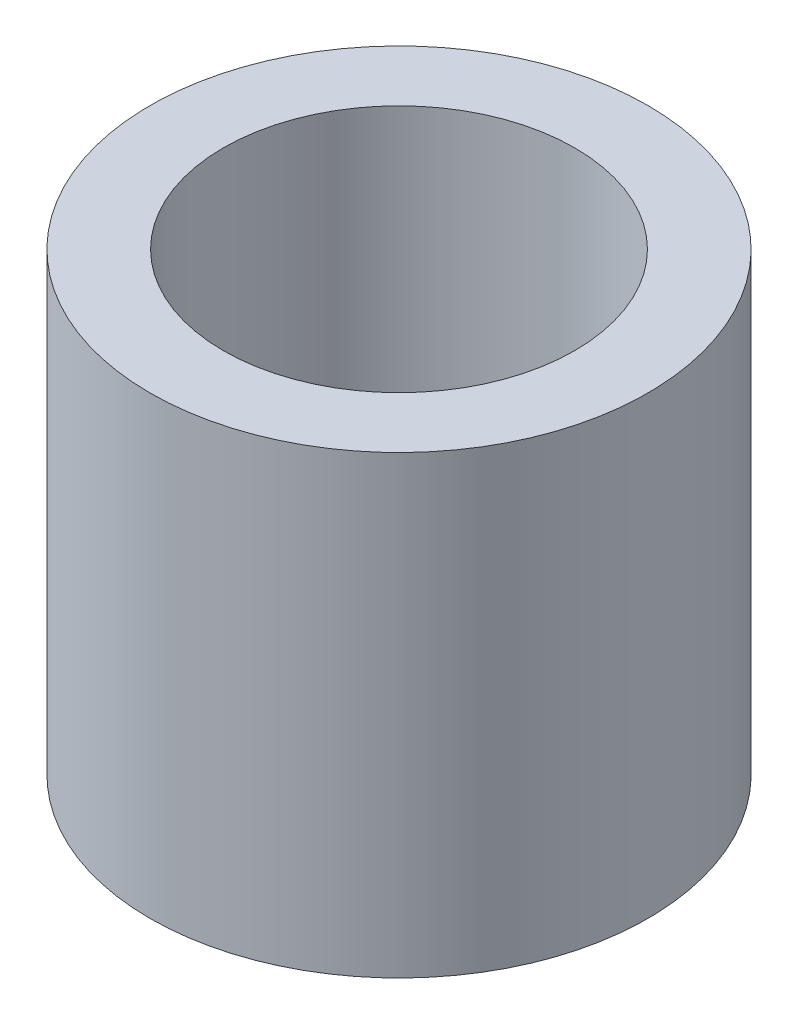
ISO-10303-21;
HEADER;
FILE_DESCRIPTION(('STEP AP214'),'2;1');
FILE_NAME('part.step','',(''),(''),'','','');
FILE_SCHEMA(('AUTOMOTIVE_DESIGN { 1 0 10303 214 1 1 1 1 }'));
ENDSEC;
DATA;
#1=APPLICATION_CONTEXT('core data for automotive mechanical design processes');
#2=APPLICATION_PROTOCOL_DEFINITION('international standard','automotive_design',2000,#1);
#3=PRODUCT_CONTEXT('',#1,'mechanical');
#4=PRODUCT('Part','Part','',(#3));
#5=PRODUCT_RELATED_PRODUCT_CATEGORY('part','',(#4));
#6=PRODUCT_DEFINITION_FORMATION('','',#4);
#7=PRODUCT_DEFINITION_CONTEXT('part definition',#1,'design');
#8=PRODUCT_DEFINITION('design','',#6,#7);
#9=PRODUCT_DEFINITION_SHAPE('','',#8);
#10=(LENGTH_UNIT() NAMED_UNIT(*) SI_UNIT(.MILLI.,.METRE.));
#11=(NAMED_UNIT(*) PLANE_ANGLE_UNIT() SI_UNIT($,.RADIAN.));
#12=(NAMED_UNIT(*) SI_UNIT($,.STERADIAN.) SOLID_ANGLE_UNIT());
#13=UNCERTAINTY_MEASURE_WITH_UNIT(LENGTH_MEASURE(1.E-05),#10,'distance_accuracy_value','');
#14=(GEOMETRIC_REPRESENTATION_CONTEXT(3) GLOBAL_UNCERTAINTY_ASSIGNED_CONTEXT((#13)) GLOBAL_UNIT_ASSIGNED_CONTEXT((#10,
#11,#12)) REPRESENTATION_CONTEXT('',''));
#15=CARTESIAN_POINT('',(0.,0.,0.));
#16=DIRECTION('',(0.,0.,1.));
#17=DIRECTION('',(1.,0.,0.));
#18=AXIS2_PLACEMENT_3D('',#15,#16,#17);
#19=CARTESIAN_POINT('',(0.,59.4069454797538,0.));
#20=DIRECTION('',(0.,-1.,0.));
#21=DIRECTION('',(0.,0.,-1.));
#22=AXIS2_PLACEMENT_3D('',#19,#20,#21);
#23=CYLINDRICAL_SURFACE('',#22,32.5);
#24=CARTESIAN_POINT('',(0.,59.4069454797538,0.));
#25=DIRECTION('',(0.,1.,0.));
#26=DIRECTION('',(0.,0.,1.));
#27=AXIS2_PLACEMENT_3D('',#24,#25,#26);
#28=CIRCLE('',#27,32.5);
#29=CARTESIAN_POINT('',(0.,59.4069454797538,-32.5));
#30=VERTEX_POINT('',#29);
#31=EDGE_CURVE('E10',#30,#30,#28,.T.);
#32=CARTESIAN_POINT('',(0.,0.,0.));
#33=DIRECTION('',(0.,1.,0.));
#34=DIRECTION('',(0.,0.,1.));
#35=AXIS2_PLACEMENT_3D('',#32,#33,#34);
#36=CIRCLE('',#35,32.5);
#37=CARTESIAN_POINT('',(0.,0.,-32.5));
#38=VERTEX_POINT('',#37);
#39=EDGE_CURVE('E37',#38,#38,#36,.T.);
#40=CARTESIAN_POINT('',(0.,59.4069454797538,-32.5));
#41=CARTESIAN_POINT('',(0.,58.7881231310064,-32.5));
#42=CARTESIAN_POINT('',(0.,58.1693007822589,-32.5));
#43=CARTESIAN_POINT('',(0.,56.9316560847641,-32.5));
#44=CARTESIAN_POINT('',(0.,56.3128337360166,-32.5));
#45=CARTESIAN_POINT('',(0.,55.0751890385217,-32.5));
#46=CARTESIAN_POINT('',(0.,54.4563666897743,-32.5));
#47=CARTESIAN_POINT('',(0.,53.2187219922794,-32.5));
#48=CARTESIAN_POINT('',(0.,52.599899643532,-32.5));
#49=CARTESIAN_POINT('',(0.,51.3622549460371,-32.5));
#50=CARTESIAN_POINT('',(0.,50.7434325972897,-32.5));
#51=CARTESIAN_POINT('',(0.,49.5057878997948,-32.5));
#52=CARTESIAN_POINT('',(0.,48.8869655510474,-32.5));
#53=CARTESIAN_POINT('',(0.,47.6493208535525,-32.5));
#54=CARTESIAN_POINT('',(0.,47.0304985048051,-32.5));
#55=CARTESIAN_POINT('',(0.,45.7928538073102,-32.5));
#56=CARTESIAN_POINT('',(0.,45.1740314585628,-32.5));
#57=CARTESIAN_POINT('',(0.,43.9363867610679,-32.5));
#58=CARTESIAN_POINT('',(0.,43.3175644123205,-32.5));
#59=CARTESIAN_POINT('',(0.,42.0799197148256,-32.5));
#60=CARTESIAN_POINT('',(0.,41.4610973660782,-32.5));
#61=CARTESIAN_POINT('',(0.,40.2234526685833,-32.5));
#62=CARTESIAN_POINT('',(0.,39.6046303198359,-32.5));
#63=CARTESIAN_POINT('',(0.,38.366985622341,-32.5));
#64=CARTESIAN_POINT('',(0.,37.7481632735936,-32.5));
#65=CARTESIAN_POINT('',(0.,36.5105185760987,-32.5));
#66=CARTESIAN_POINT('',(0.,35.8916962273512,-32.5));
#67=CARTESIAN_POINT('',(0.,34.6540515298564,-32.5));
#68=CARTESIAN_POINT('',(0.,34.0352291811089,-32.5));
#69=CARTESIAN_POINT('',(0.,32.7975844836141,-32.5));
#70=CARTESIAN_POINT('',(0.,32.1787621348666,-32.5));
#71=CARTESIAN_POINT('',(0.,30.9411174373718,-32.5));
#72=CARTESIAN_POINT('',(0.,30.3222950886243,-32.5));
#73=CARTESIAN_POINT('',(0.,29.0846503911295,-32.5));
#74=CARTESIAN_POINT('',(0.,28.465828042382,-32.5));
#75=CARTESIAN_POINT('',(0.,27.2281833448872,-32.5));
#76=CARTESIAN_POINT('',(0.,26.6093609961397,-32.5));
#77=CARTESIAN_POINT('',(0.,25.3717162986449,-32.5));
#78=CARTESIAN_POINT('',(0.,24.7528939498974,-32.5));
#79=CARTESIAN_POINT('',(0.,23.5152492524025,-32.5));
#80=CARTESIAN_POINT('',(0.,22.8964269036551,-32.5));
#81=CARTESIAN_POINT('',(0.,21.6587822061602,-32.5));
#82=CARTESIAN_POINT('',(0.,21.0399598574128,-32.5));
#83=CARTESIAN_POINT('',(0.,19.8023151599179,-32.5));
#84=CARTESIAN_POINT('',(0.,19.1834928111705,-32.5));
#85=CARTESIAN_POINT('',(0.,17.9458481136756,-32.5));
#86=CARTESIAN_POINT('',(0.,17.3270257649282,-32.5));
#87=CARTESIAN_POINT('',(0.,16.0893810674333,-32.5));
#88=CARTESIAN_POINT('',(0.,15.4705587186859,-32.5));
#89=CARTESIAN_POINT('',(0.,14.232914021191,-32.5));
#90=CARTESIAN_POINT('',(0.,13.6140916724436,-32.5));
#91=CARTESIAN_POINT('',(0.,12.3764469749487,-32.5));
#92=CARTESIAN_POINT('',(0.,11.7576246262013,-32.5));
#93=CARTESIAN_POINT('',(0.,10.5199799287064,-32.5));
#94=CARTESIAN_POINT('',(0.,9.90115757995896,-32.5));
#95=CARTESIAN_POINT('',(0.,8.66351288246409,-32.5));
#96=CARTESIAN_POINT('',(0.,8.04469053371665,-32.5));
#97=CARTESIAN_POINT('',(0.,6.80704583622178,-32.5));
#98=CARTESIAN_POINT('',(0.,6.18822348747435,-32.5));
#99=CARTESIAN_POINT('',(0.,4.95057878997948,-32.5));
#100=CARTESIAN_POINT('',(0.,4.33175644123204,-32.5));
#101=CARTESIAN_POINT('',(0.,3.09411174373717,-32.5));
#102=CARTESIAN_POINT('',(0.,2.47528939498974,-32.5));
#103=CARTESIAN_POINT('',(0.,1.23764469749487,-32.5));
#104=CARTESIAN_POINT('',(0.,0.618822348747429,-32.5));
#105=CARTESIAN_POINT('',(0.,0.,-32.5));
#106=B_SPLINE_CURVE_WITH_KNOTS('',3,(#40,#41,#42,#43,#44,#45,#46,#47,#48,#49,#50,#51,#52,#53,
#54,#55,#56,#57,#58,#59,#60,#61,#62,#63,#64,#65,#66,#67,#68,#69,#70,#71,#72,#73,#74,#75,#76,#77,
#78,#79,#80,#81,#82,#83,#84,#85,#86,#87,#88,#89,#90,#91,#92,#93,#94,#95,#96,#97,#98,#99,#100,
#101,#102,#103,#104,#105),.UNSPECIFIED.,.F.,.F.,(4,2,2,2,2,2,2,2,2,2,2,2,2,2,2,2,2,2,2,2,2,2,2,
2,2,2,2,2,2,2,2,2,4),(0.,1.85646704624231,3.71293409248462,5.56940113872692,7.42586818496923,
9.28233523121153,11.1388022774538,12.9952693236961,14.8517363699385,16.7082034161808,
18.5646704624231,20.4211375086654,22.2776045549077,24.13407160115,25.9905386473923,
27.8470056936346,29.7034727398769,31.5599397861192,33.4164068323615,35.2728738786038,
37.1293409248461,38.9858079710884,40.8422750173307,42.698742063573,44.5552091098154,
46.4116761560577,48.2681432023,50.1246102485423,51.9810772947846,53.8375443410269,
55.6940113872692,57.5504784335115,59.4069454797538),.UNSPECIFIED.);
#107=EDGE_CURVE('BSEAM40',#30,#38,#106,.T.);
#108=ORIENTED_EDGE('',*,*,#31,.F.);
#109=ORIENTED_EDGE('',*,*,#39,.T.);
#110=ORIENTED_EDGE('',*,*,#107,.T.);
#111=ORIENTED_EDGE('',*,*,#107,.F.);
#112=EDGE_LOOP('',(#108,#110,#109,#111));
#113=FACE_BOUND('',#112,.T.);
#114=ADVANCED_FACE('F40',(#113),#23,.T.);
#115=CARTESIAN_POINT('',(0.,59.4069454797538,0.));
#116=DIRECTION('',(0.,1.,0.));
#117=DIRECTION('',(0.,0.,1.));
#118=AXIS2_PLACEMENT_3D('',#115,#116,#117);
#119=PLANE('',#118);
#120=CARTESIAN_POINT('',(0.,59.4069454797538,0.));
#121=DIRECTION('',(0.,1.,0.));
#122=DIRECTION('',(0.,0.,1.));
#123=AXIS2_PLACEMENT_3D('',#120,#121,#122);
#124=CIRCLE('',#123,22.9329598543103);
#125=CARTESIAN_POINT('',(0.,59.4069454797538,-22.9329598543103));
#126=VERTEX_POINT('',#125);
#127=EDGE_CURVE('E50',#126,#126,#124,.T.);
#128=ORIENTED_EDGE('',*,*,#127,.F.);
#129=EDGE_LOOP('',(#128));
#130=FACE_BOUND('',#129,.T.);
#131=ORIENTED_EDGE('',*,*,#31,.T.);
#132=EDGE_LOOP('',(#131));
#133=FACE_BOUND('',#132,.T.);
#134=ADVANCED_FACE('F59',(#130,#133),#119,.T.);
#135=CARTESIAN_POINT('',(0.,0.,0.));
#136=DIRECTION('',(0.,1.,0.));
#137=DIRECTION('',(0.,0.,1.));
#138=AXIS2_PLACEMENT_3D('',#135,#136,#137);
#139=PLANE('',#138);
#140=CARTESIAN_POINT('',(0.,0.,0.));
#141=DIRECTION('',(0.,1.,0.));
#142=DIRECTION('',(0.,0.,1.));
#143=AXIS2_PLACEMENT_3D('',#140,#141,#142);
#144=CIRCLE('',#143,22.9329598543103);
#145=CARTESIAN_POINT('',(0.,0.,-22.9329598543103));
#146=VERTEX_POINT('',#145);
#147=EDGE_CURVE('E47',#146,#146,#144,.T.);
#148=ORIENTED_EDGE('',*,*,#147,.T.);
#149=EDGE_LOOP('',(#148));
#150=FACE_BOUND('',#149,.T.);
#151=ORIENTED_EDGE('',*,*,#39,.F.);
#152=EDGE_LOOP('',(#151));
#153=FACE_BOUND('',#152,.T.);
#154=ADVANCED_FACE('F58',(#150,#153),#139,.F.);
#155=CARTESIAN_POINT('',(0.,59.4069454797538,0.));
#156=DIRECTION('',(0.,-1.,0.));
#157=DIRECTION('',(0.,0.,-1.));
#158=AXIS2_PLACEMENT_3D('',#155,#156,#157);
#159=CYLINDRICAL_SURFACE('',#158,22.9329598543103);
#160=CARTESIAN_POINT('',(0.,59.4069454797538,-22.9329598543103));
#161=CARTESIAN_POINT('',(0.,58.7881231310064,-22.9329598543103));
#162=CARTESIAN_POINT('',(0.,58.1693007822589,-22.9329598543103));
#163=CARTESIAN_POINT('',(0.,56.9316560847641,-22.9329598543103));
#164=CARTESIAN_POINT('',(0.,56.3128337360166,-22.9329598543103));
#165=CARTESIAN_POINT('',(0.,55.0751890385217,-22.9329598543103));
#166=CARTESIAN_POINT('',(0.,54.4563666897743,-22.9329598543103));
#167=CARTESIAN_POINT('',(0.,53.2187219922794,-22.9329598543103));
#168=CARTESIAN_POINT('',(0.,52.599899643532,-22.9329598543103));
#169=CARTESIAN_POINT('',(0.,51.3622549460371,-22.9329598543103));
#170=CARTESIAN_POINT('',(0.,50.7434325972897,-22.9329598543103));
#171=CARTESIAN_POINT('',(0.,49.5057878997948,-22.9329598543103));
#172=CARTESIAN_POINT('',(0.,48.8869655510474,-22.9329598543103));
#173=CARTESIAN_POINT('',(0.,47.6493208535525,-22.9329598543103));
#174=CARTESIAN_POINT('',(0.,47.0304985048051,-22.9329598543103));
#175=CARTESIAN_POINT('',(0.,45.7928538073102,-22.9329598543103));
#176=CARTESIAN_POINT('',(0.,45.1740314585628,-22.9329598543103));
#177=CARTESIAN_POINT('',(0.,43.9363867610679,-22.9329598543103));
#178=CARTESIAN_POINT('',(0.,43.3175644123205,-22.9329598543103));
#179=CARTESIAN_POINT('',(0.,42.0799197148256,-22.9329598543103));
#180=CARTESIAN_POINT('',(0.,41.4610973660782,-22.9329598543103));
#181=CARTESIAN_POINT('',(0.,40.2234526685833,-22.9329598543103));
#182=CARTESIAN_POINT('',(0.,39.6046303198359,-22.9329598543103));
#183=CARTESIAN_POINT('',(0.,38.366985622341,-22.9329598543103));
#184=CARTESIAN_POINT('',(0.,37.7481632735936,-22.9329598543103));
#185=CARTESIAN_POINT('',(0.,36.5105185760987,-22.9329598543103));
#186=CARTESIAN_POINT('',(0.,35.8916962273512,-22.9329598543103));
#187=CARTESIAN_POINT('',(0.,34.6540515298564,-22.9329598543103));
#188=CARTESIAN_POINT('',(0.,34.0352291811089,-22.9329598543103));
#189=CARTESIAN_POINT('',(0.,32.7975844836141,-22.9329598543103));
#190=CARTESIAN_POINT('',(0.,32.1787621348666,-22.9329598543103));
#191=CARTESIAN_POINT('',(0.,30.9411174373718,-22.9329598543103));
#192=CARTESIAN_POINT('',(0.,30.3222950886243,-22.9329598543103));
#193=CARTESIAN_POINT('',(0.,29.0846503911295,-22.9329598543103));
#194=CARTESIAN_POINT('',(0.,28.465828042382,-22.9329598543103));
#195=CARTESIAN_POINT('',(0.,27.2281833448872,-22.9329598543103));
#196=CARTESIAN_POINT('',(0.,26.6093609961397,-22.9329598543103));
#197=CARTESIAN_POINT('',(0.,25.3717162986448,-22.9329598543103));
#198=CARTESIAN_POINT('',(0.,24.7528939498974,-22.9329598543103));
#199=CARTESIAN_POINT('',(0.,23.5152492524025,-22.9329598543103));
#200=CARTESIAN_POINT('',(0.,22.8964269036551,-22.9329598543103));
#201=CARTESIAN_POINT('',(0.,21.6587822061602,-22.9329598543103));
#202=CARTESIAN_POINT('',(0.,21.0399598574128,-22.9329598543103));
#203=CARTESIAN_POINT('',(0.,19.8023151599179,-22.9329598543103));
#204=CARTESIAN_POINT('',(0.,19.1834928111705,-22.9329598543103));
#205=CARTESIAN_POINT('',(0.,17.9458481136756,-22.9329598543103));
#206=CARTESIAN_POINT('',(0.,17.3270257649282,-22.9329598543103));
#207=CARTESIAN_POINT('',(0.,16.0893810674333,-22.9329598543103));
#208=CARTESIAN_POINT('',(0.,15.4705587186859,-22.9329598543103));
#209=CARTESIAN_POINT('',(0.,14.232914021191,-22.9329598543103));
#210=CARTESIAN_POINT('',(0.,13.6140916724436,-22.9329598543103));
#211=CARTESIAN_POINT('',(0.,12.3764469749487,-22.9329598543103));
#212=CARTESIAN_POINT('',(0.,11.7576246262013,-22.9329598543103));
#213=CARTESIAN_POINT('',(0.,10.5199799287064,-22.9329598543103));
#214=CARTESIAN_POINT('',(0.,9.90115757995896,-22.9329598543103));
#215=CARTESIAN_POINT('',(0.,8.66351288246409,-22.9329598543103));
#216=CARTESIAN_POINT('',(0.,8.04469053371665,-22.9329598543103));
#217=CARTESIAN_POINT('',(0.,6.80704583622178,-22.9329598543103));
#218=CARTESIAN_POINT('',(0.,6.18822348747435,-22.9329598543103));
#219=CARTESIAN_POINT('',(0.,4.95057878997948,-22.9329598543103));
#220=CARTESIAN_POINT('',(0.,4.33175644123204,-22.9329598543103));
#221=CARTESIAN_POINT('',(0.,3.09411174373717,-22.9329598543103));
#222=CARTESIAN_POINT('',(0.,2.47528939498974,-22.9329598543103));
#223=CARTESIAN_POINT('',(0.,1.23764469749487,-22.9329598543103));
#224=CARTESIAN_POINT('',(0.,0.618822348747429,-22.9329598543103));
#225=CARTESIAN_POINT('',(0.,0.,-22.9329598543103));
#226=B_SPLINE_CURVE_WITH_KNOTS('',3,(#160,#161,#162,#163,#164,#165,#166,#167,#168,#169,#170,
#171,#172,#173,#174,#175,#176,#177,#178,#179,#180,#181,#182,#183,#184,#185,#186,#187,#188,#189,
#190,#191,#192,#193,#194,#195,#196,#197,#198,#199,#200,#201,#202,#203,#204,#205,#206,#207,#208,
#209,#210,#211,#212,#213,#214,#215,#216,#217,#218,#219,#220,#221,#222,#223,#224,#225),
.UNSPECIFIED.,.F.,.F.,(4,2,2,2,2,2,2,2,2,2,2,2,2,2,2,2,2,2,2,2,2,2,2,2,2,2,2,2,2,2,2,2,4),(0.,
1.8564670462423,3.71293409248461,5.56940113872691,7.42586818496922,9.28233523121152,
11.1388022774538,12.9952693236961,14.8517363699384,16.7082034161808,18.5646704624231,
20.4211375086654,22.2776045549077,24.13407160115,25.9905386473923,27.8470056936346,
29.7034727398769,31.5599397861192,33.4164068323615,35.2728738786038,37.1293409248461,
38.9858079710884,40.8422750173307,42.698742063573,44.5552091098153,46.4116761560577,
48.2681432023,50.1246102485423,51.9810772947846,53.8375443410269,55.6940113872692,
57.5504784335115,59.4069454797538),.UNSPECIFIED.);
#227=EDGE_CURVE('BSEAM54',#126,#146,#226,.T.);
#228=ORIENTED_EDGE('',*,*,#127,.T.);
#229=ORIENTED_EDGE('',*,*,#147,.F.);
#230=ORIENTED_EDGE('',*,*,#227,.T.);
#231=ORIENTED_EDGE('',*,*,#227,.F.);
#232=EDGE_LOOP('',(#228,#230,#229,#231));
#233=FACE_BOUND('',#232,.T.);
#234=ADVANCED_FACE('F54',(#233),#159,.F.);
#235=CLOSED_SHELL('',(#114,#134,#154,#234));
#236=MANIFOLD_SOLID_BREP('B2',#235);
#237=ADVANCED_BREP_SHAPE_REPRESENTATION('',(#18,#236),#14);
#238=SHAPE_DEFINITION_REPRESENTATION(#9,#237);
ENDSEC;
END-ISO-10303-21;
